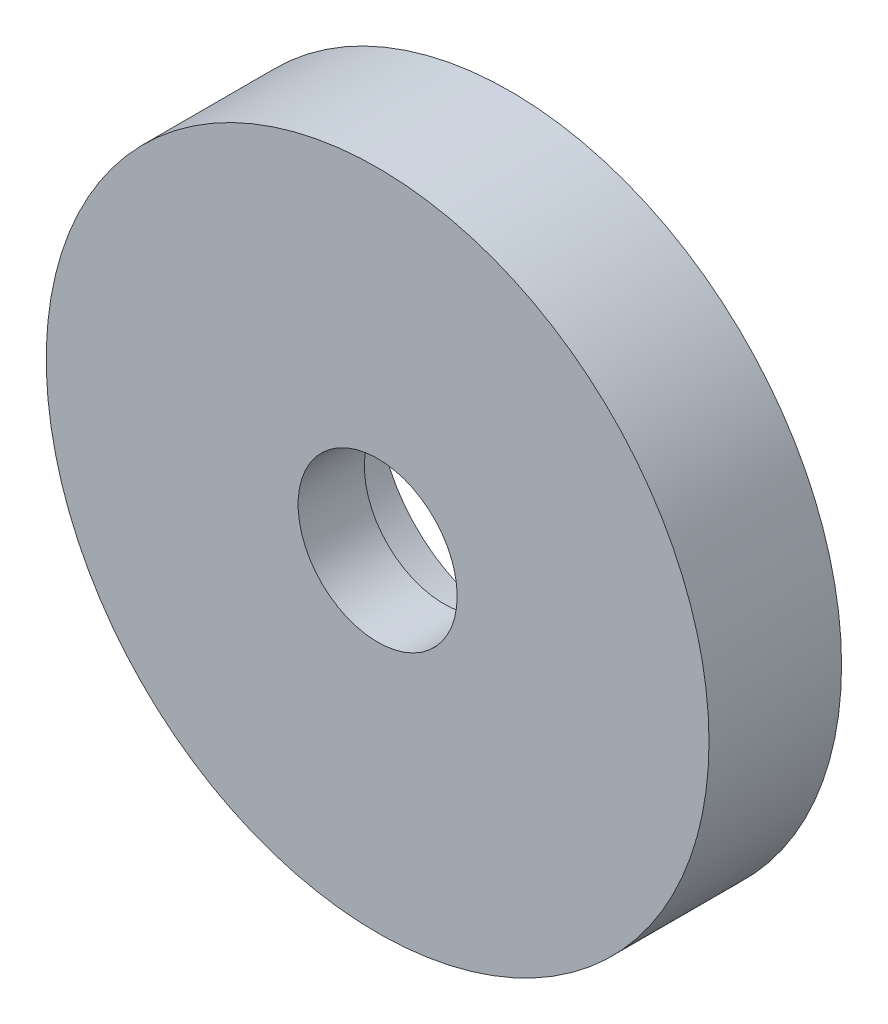
ISO-10303-21;
HEADER;
FILE_DESCRIPTION(('STEP AP214'),'2;1');
FILE_NAME('part.step','',(''),(''),'','','');
FILE_SCHEMA(('AUTOMOTIVE_DESIGN { 1 0 10303 214 1 1 1 1 }'));
ENDSEC;
DATA;
#1=APPLICATION_CONTEXT('core data for automotive mechanical design processes');
#2=APPLICATION_PROTOCOL_DEFINITION('international standard','automotive_design',2000,#1);
#3=PRODUCT_CONTEXT('',#1,'mechanical');
#4=PRODUCT('Part','Part','',(#3));
#5=PRODUCT_RELATED_PRODUCT_CATEGORY('part','',(#4));
#6=PRODUCT_DEFINITION_FORMATION('','',#4);
#7=PRODUCT_DEFINITION_CONTEXT('part definition',#1,'design');
#8=PRODUCT_DEFINITION('design','',#6,#7);
#9=PRODUCT_DEFINITION_SHAPE('','',#8);
#10=(LENGTH_UNIT() NAMED_UNIT(*) SI_UNIT(.MILLI.,.METRE.));
#11=(NAMED_UNIT(*) PLANE_ANGLE_UNIT() SI_UNIT($,.RADIAN.));
#12=(NAMED_UNIT(*) SI_UNIT($,.STERADIAN.) SOLID_ANGLE_UNIT());
#13=UNCERTAINTY_MEASURE_WITH_UNIT(LENGTH_MEASURE(1.E-05),#10,'distance_accuracy_value','');
#14=(GEOMETRIC_REPRESENTATION_CONTEXT(3) GLOBAL_UNCERTAINTY_ASSIGNED_CONTEXT((#13)) GLOBAL_UNIT_ASSIGNED_CONTEXT((#10,
#11,#12)) REPRESENTATION_CONTEXT('',''));
#15=CARTESIAN_POINT('',(0.,0.,0.));
#16=DIRECTION('',(0.,0.,1.));
#17=DIRECTION('',(1.,0.,0.));
#18=AXIS2_PLACEMENT_3D('',#15,#16,#17);
#19=CARTESIAN_POINT('',(0.,0.,10.));
#20=DIRECTION('',(0.,0.,-1.));
#21=DIRECTION('',(-1.,0.,0.));
#22=AXIS2_PLACEMENT_3D('',#19,#20,#21);
#23=CYLINDRICAL_SURFACE('',#22,25.);
#24=CARTESIAN_POINT('',(0.,0.,10.));
#25=DIRECTION('',(0.,0.,1.));
#26=DIRECTION('',(1.,0.,0.));
#27=AXIS2_PLACEMENT_3D('',#24,#25,#26);
#28=CIRCLE('',#27,25.);
#29=CARTESIAN_POINT('',(25.,0.,10.));
#30=VERTEX_POINT('',#29);
#31=EDGE_CURVE('E10',#30,#30,#28,.T.);
#32=ORIENTED_EDGE('',*,*,#31,.F.);
#33=EDGE_LOOP('',(#32));
#34=FACE_BOUND('',#33,.T.);
#35=CARTESIAN_POINT('',(0.,0.,0.));
#36=DIRECTION('',(0.,0.,1.));
#37=DIRECTION('',(1.,0.,0.));
#38=AXIS2_PLACEMENT_3D('',#35,#36,#37);
#39=CIRCLE('',#38,25.);
#40=CARTESIAN_POINT('',(25.,0.,0.));
#41=VERTEX_POINT('',#40);
#42=EDGE_CURVE('E34',#41,#41,#39,.T.);
#43=ORIENTED_EDGE('',*,*,#42,.T.);
#44=EDGE_LOOP('',(#43));
#45=FACE_BOUND('',#44,.T.);
#46=ADVANCED_FACE('F31',(#34,#45),#23,.T.);
#47=CARTESIAN_POINT('',(0.,0.,10.));
#48=DIRECTION('',(0.,0.,1.));
#49=DIRECTION('',(1.,0.,0.));
#50=AXIS2_PLACEMENT_3D('',#47,#48,#49);
#51=PLANE('',#50);
#52=CARTESIAN_POINT('',(0.,0.,10.));
#53=DIRECTION('',(0.,0.,1.));
#54=DIRECTION('',(1.,0.,0.));
#55=AXIS2_PLACEMENT_3D('',#52,#53,#54);
#56=CIRCLE('',#55,6.);
#57=CARTESIAN_POINT('',(6.,0.,10.));
#58=VERTEX_POINT('',#57);
#59=EDGE_CURVE('E41',#58,#58,#56,.T.);
#60=ORIENTED_EDGE('',*,*,#59,.F.);
#61=EDGE_LOOP('',(#60));
#62=FACE_BOUND('',#61,.T.);
#63=ORIENTED_EDGE('',*,*,#31,.T.);
#64=EDGE_LOOP('',(#63));
#65=FACE_BOUND('',#64,.T.);
#66=ADVANCED_FACE('F68',(#62,#65),#51,.T.);
#67=CARTESIAN_POINT('',(0.,0.,0.));
#68=DIRECTION('',(0.,0.,1.));
#69=DIRECTION('',(1.,0.,0.));
#70=AXIS2_PLACEMENT_3D('',#67,#68,#69);
#71=PLANE('',#70);
#72=CARTESIAN_POINT('',(0.,0.,0.));
#73=DIRECTION('',(0.,0.,-1.));
#74=DIRECTION('',(-1.,0.,0.));
#75=AXIS2_PLACEMENT_3D('',#72,#73,#74);
#76=CIRCLE('',#75,10.);
#77=CARTESIAN_POINT('',(-10.,0.,0.));
#78=VERTEX_POINT('',#77);
#79=EDGE_CURVE('E49',#78,#78,#76,.T.);
#80=ORIENTED_EDGE('',*,*,#79,.F.);
#81=EDGE_LOOP('',(#80));
#82=FACE_BOUND('',#81,.T.);
#83=ORIENTED_EDGE('',*,*,#42,.F.);
#84=EDGE_LOOP('',(#83));
#85=FACE_BOUND('',#84,.T.);
#86=ADVANCED_FACE('F64',(#82,#85),#71,.F.);
#87=CARTESIAN_POINT('',(0.,0.,5.));
#88=DIRECTION('',(0.,0.,1.));
#89=DIRECTION('',(1.,0.,0.));
#90=AXIS2_PLACEMENT_3D('',#87,#88,#89);
#91=CYLINDRICAL_SURFACE('',#90,6.);
#92=CARTESIAN_POINT('',(0.,0.,5.));
#93=DIRECTION('',(0.,0.,1.));
#94=DIRECTION('',(1.,0.,0.));
#95=AXIS2_PLACEMENT_3D('',#92,#93,#94);
#96=CIRCLE('',#95,6.);
#97=CARTESIAN_POINT('',(6.,0.,5.));
#98=VERTEX_POINT('',#97);
#99=EDGE_CURVE('E45',#98,#98,#96,.T.);
#100=ORIENTED_EDGE('',*,*,#99,.F.);
#101=EDGE_LOOP('',(#100));
#102=FACE_BOUND('',#101,.T.);
#103=ORIENTED_EDGE('',*,*,#59,.T.);
#104=EDGE_LOOP('',(#103));
#105=FACE_BOUND('',#104,.T.);
#106=ADVANCED_FACE('F67',(#102,#105),#91,.F.);
#107=CARTESIAN_POINT('',(0.,0.,5.));
#108=DIRECTION('',(0.,0.,-1.));
#109=DIRECTION('',(-1.,0.,0.));
#110=AXIS2_PLACEMENT_3D('',#107,#108,#109);
#111=PLANE('',#110);
#112=CARTESIAN_POINT('',(0.,0.,5.));
#113=DIRECTION('',(0.,0.,-1.));
#114=DIRECTION('',(-1.,0.,0.));
#115=AXIS2_PLACEMENT_3D('',#112,#113,#114);
#116=CIRCLE('',#115,10.);
#117=CARTESIAN_POINT('',(-10.,0.,5.));
#118=VERTEX_POINT('',#117);
#119=EDGE_CURVE('E48',#118,#118,#116,.T.);
#120=ORIENTED_EDGE('',*,*,#119,.T.);
#121=EDGE_LOOP('',(#120));
#122=FACE_BOUND('',#121,.T.);
#123=ORIENTED_EDGE('',*,*,#99,.T.);
#124=EDGE_LOOP('',(#123));
#125=FACE_BOUND('',#124,.T.);
#126=ADVANCED_FACE('F55',(#122,#125),#111,.T.);
#127=CARTESIAN_POINT('',(0.,0.,5.));
#128=DIRECTION('',(0.,0.,-1.));
#129=DIRECTION('',(-1.,0.,0.));
#130=AXIS2_PLACEMENT_3D('',#127,#128,#129);
#131=CYLINDRICAL_SURFACE('',#130,10.);
#132=ORIENTED_EDGE('',*,*,#119,.F.);
#133=EDGE_LOOP('',(#132));
#134=FACE_BOUND('',#133,.T.);
#135=ORIENTED_EDGE('',*,*,#79,.T.);
#136=EDGE_LOOP('',(#135));
#137=FACE_BOUND('',#136,.T.);
#138=ADVANCED_FACE('F58',(#134,#137),#131,.F.);
#139=CLOSED_SHELL('',(#46,#66,#86,#106,#126,#138));
#140=MANIFOLD_SOLID_BREP('B2',#139);
#141=ADVANCED_BREP_SHAPE_REPRESENTATION('',(#18,#140),#14);
#142=SHAPE_DEFINITION_REPRESENTATION(#9,#141);
ENDSEC;
END-ISO-10303-21;
